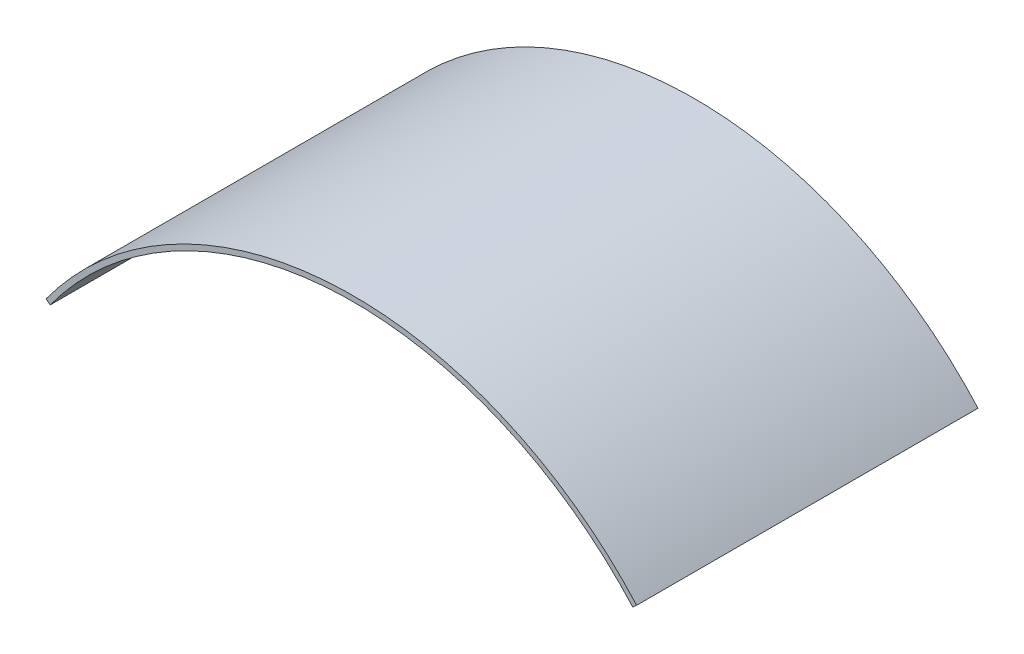
ISO-10303-21;
HEADER;
FILE_DESCRIPTION(('STEP AP214'),'2;1');
FILE_NAME('part.step','',(''),(''),'','','');
FILE_SCHEMA(('AUTOMOTIVE_DESIGN { 1 0 10303 214 1 1 1 1 }'));
ENDSEC;
DATA;
#1=APPLICATION_CONTEXT('core data for automotive mechanical design processes');
#2=APPLICATION_PROTOCOL_DEFINITION('international standard','automotive_design',2000,#1);
#3=PRODUCT_CONTEXT('',#1,'mechanical');
#4=PRODUCT('Part','Part','',(#3));
#5=PRODUCT_RELATED_PRODUCT_CATEGORY('part','',(#4));
#6=PRODUCT_DEFINITION_FORMATION('','',#4);
#7=PRODUCT_DEFINITION_CONTEXT('part definition',#1,'design');
#8=PRODUCT_DEFINITION('design','',#6,#7);
#9=PRODUCT_DEFINITION_SHAPE('','',#8);
#10=(LENGTH_UNIT() NAMED_UNIT(*) SI_UNIT(.MILLI.,.METRE.));
#11=(NAMED_UNIT(*) PLANE_ANGLE_UNIT() SI_UNIT($,.RADIAN.));
#12=(NAMED_UNIT(*) SI_UNIT($,.STERADIAN.) SOLID_ANGLE_UNIT());
#13=UNCERTAINTY_MEASURE_WITH_UNIT(LENGTH_MEASURE(1.E-05),#10,'distance_accuracy_value','');
#14=(GEOMETRIC_REPRESENTATION_CONTEXT(3) GLOBAL_UNCERTAINTY_ASSIGNED_CONTEXT((#13)) GLOBAL_UNIT_ASSIGNED_CONTEXT((#10,
#11,#12)) REPRESENTATION_CONTEXT('',''));
#15=CARTESIAN_POINT('',(0.,0.,0.));
#16=DIRECTION('',(0.,0.,1.));
#17=DIRECTION('',(1.,0.,0.));
#18=AXIS2_PLACEMENT_3D('',#15,#16,#17);
#19=CARTESIAN_POINT('',(102.23472331392,-74.4996951874995,113.5));
#20=DIRECTION('',(0.,0.,-1.));
#21=DIRECTION('',(-1.,0.,0.));
#22=AXIS2_PLACEMENT_3D('',#19,#20,#21);
#23=CYLINDRICAL_SURFACE('',#22,126.499577999707);
#24=CARTESIAN_POINT('',(102.23472331392,-74.4996951874995,0.));
#25=DIRECTION('',(0.,0.,1.));
#26=DIRECTION('',(-1.,0.,0.));
#27=AXIS2_PLACEMENT_3D('',#24,#25,#26);
#28=CIRCLE('',#27,126.499577999707);
#29=CARTESIAN_POINT('',(196.404368836428,9.96462329237191,0.));
#30=VERTEX_POINT('',#29);
#31=CARTESIAN_POINT('',(0.,0.,0.));
#32=VERTEX_POINT('',#31);
#33=EDGE_CURVE('E113',#30,#32,#28,.T.);
#34=ORIENTED_EDGE('',*,*,#33,.T.);
#35=DIRECTION('',(0.,0.,-1.));
#36=VECTOR('',#35,1.);
#37=CARTESIAN_POINT('',(0.,0.,113.5));
#38=LINE('',#37,#36);
#39=CARTESIAN_POINT('',(0.,0.,113.5));
#40=VERTEX_POINT('',#39);
#41=EDGE_CURVE('E11',#40,#32,#38,.T.);
#42=ORIENTED_EDGE('',*,*,#41,.F.);
#43=CARTESIAN_POINT('',(102.23472331392,-74.4996951874995,113.5));
#44=DIRECTION('',(0.,0.,1.));
#45=DIRECTION('',(-1.,0.,0.));
#46=AXIS2_PLACEMENT_3D('',#43,#44,#45);
#47=CIRCLE('',#46,126.499577999707);
#48=CARTESIAN_POINT('',(196.404368836428,9.96462329237191,113.5));
#49=VERTEX_POINT('',#48);
#50=EDGE_CURVE('E96',#49,#40,#47,.T.);
#51=ORIENTED_EDGE('',*,*,#50,.F.);
#52=DIRECTION('',(0.,0.,-1.));
#53=VECTOR('',#52,1.);
#54=CARTESIAN_POINT('',(196.404368836428,9.96462329237191,113.5));
#55=LINE('',#54,#53);
#56=EDGE_CURVE('E109',#49,#30,#55,.T.);
#57=ORIENTED_EDGE('',*,*,#56,.T.);
#58=EDGE_LOOP('',(#34,#42,#51,#57));
#59=FACE_BOUND('',#58,.T.);
#60=ADVANCED_FACE('F38',(#59),#23,.T.);
#61=CARTESIAN_POINT('',(0.,0.,113.5));
#62=DIRECTION('',(0.58893236140023,0.80818232701263,0.));
#63=DIRECTION('',(-0.80818232701263,0.58893236140023,0.));
#64=AXIS2_PLACEMENT_3D('',#61,#62,#63);
#65=PLANE('',#64);
#66=DIRECTION('',(0.80818232701263,-0.58893236140023,0.));
#67=VECTOR('',#66,1.);
#68=CARTESIAN_POINT('',(0.,0.,0.));
#69=LINE('',#68,#67);
#70=CARTESIAN_POINT('',(1.4143190722721,-1.0306316324504,0.));
#71=VERTEX_POINT('',#70);
#72=EDGE_CURVE('E100',#32,#71,#69,.T.);
#73=ORIENTED_EDGE('',*,*,#72,.T.);
#74=DIRECTION('',(0.,0.,-1.));
#75=VECTOR('',#74,1.);
#76=CARTESIAN_POINT('',(1.4143190722721,-1.0306316324504,113.5));
#77=LINE('',#76,#75);
#78=CARTESIAN_POINT('',(1.4143190722721,-1.0306316324504,113.5));
#79=VERTEX_POINT('',#78);
#80=EDGE_CURVE('E47',#79,#71,#77,.T.);
#81=ORIENTED_EDGE('',*,*,#80,.F.);
#82=DIRECTION('',(0.80818232701263,-0.58893236140023,0.));
#83=VECTOR('',#82,1.);
#84=CARTESIAN_POINT('',(0.,0.,113.5));
#85=LINE('',#84,#83);
#86=EDGE_CURVE('E91',#40,#79,#85,.T.);
#87=ORIENTED_EDGE('',*,*,#86,.F.);
#88=ORIENTED_EDGE('',*,*,#41,.T.);
#89=EDGE_LOOP('',(#73,#81,#87,#88));
#90=FACE_BOUND('',#89,.T.);
#91=ADVANCED_FACE('F99',(#90),#65,.F.);
#92=CARTESIAN_POINT('',(102.23472331392,-74.4996951874995,113.5));
#93=DIRECTION('',(0.,0.,-1.));
#94=DIRECTION('',(-1.,0.,0.));
#95=AXIS2_PLACEMENT_3D('',#92,#93,#94);
#96=CYLINDRICAL_SURFACE('',#95,124.749577999707);
#97=CARTESIAN_POINT('',(102.23472331392,-74.4996951874995,0.));
#98=DIRECTION('',(0.,0.,-1.));
#99=DIRECTION('',(-1.,0.,0.));
#100=AXIS2_PLACEMENT_3D('',#97,#98,#99);
#101=CIRCLE('',#100,124.749577999707);
#102=CARTESIAN_POINT('',(195.10162235877,8.79614068019977,0.));
#103=VERTEX_POINT('',#102);
#104=EDGE_CURVE('E78',#71,#103,#101,.T.);
#105=ORIENTED_EDGE('',*,*,#104,.T.);
#106=DIRECTION('',(0.,0.,-1.));
#107=VECTOR('',#106,1.);
#108=CARTESIAN_POINT('',(195.10162235877,8.79614068019977,113.5));
#109=LINE('',#108,#107);
#110=CARTESIAN_POINT('',(195.10162235877,8.79614068019977,113.5));
#111=VERTEX_POINT('',#110);
#112=EDGE_CURVE('E102',#111,#103,#109,.T.);
#113=ORIENTED_EDGE('',*,*,#112,.F.);
#114=CARTESIAN_POINT('',(102.23472331392,-74.4996951874995,113.5));
#115=DIRECTION('',(0.,0.,-1.));
#116=DIRECTION('',(-1.,0.,0.));
#117=AXIS2_PLACEMENT_3D('',#114,#115,#116);
#118=CIRCLE('',#117,124.749577999707);
#119=EDGE_CURVE('E94',#79,#111,#118,.T.);
#120=ORIENTED_EDGE('',*,*,#119,.F.);
#121=ORIENTED_EDGE('',*,*,#80,.T.);
#122=EDGE_LOOP('',(#105,#113,#120,#121));
#123=FACE_BOUND('',#122,.T.);
#124=ADVANCED_FACE('F103',(#123),#96,.F.);
#125=CARTESIAN_POINT('',(196.404368836428,9.96462329237191,113.5));
#126=DIRECTION('',(-0.667704349812663,0.744426558661933,0.));
#127=DIRECTION('',(-0.744426558661933,-0.667704349812663,0.));
#128=AXIS2_PLACEMENT_3D('',#125,#126,#127);
#129=PLANE('',#128);
#130=DIRECTION('',(0.744426558661933,0.667704349812663,0.));
#131=VECTOR('',#130,1.);
#132=CARTESIAN_POINT('',(196.404368836428,9.96462329237191,0.));
#133=LINE('',#132,#131);
#134=EDGE_CURVE('E84',#103,#30,#133,.T.);
#135=ORIENTED_EDGE('',*,*,#134,.T.);
#136=ORIENTED_EDGE('',*,*,#56,.F.);
#137=DIRECTION('',(0.744426558661933,0.667704349812663,0.));
#138=VECTOR('',#137,1.);
#139=CARTESIAN_POINT('',(196.404368836428,9.96462329237191,113.5));
#140=LINE('',#139,#138);
#141=EDGE_CURVE('E58',#111,#49,#140,.T.);
#142=ORIENTED_EDGE('',*,*,#141,.F.);
#143=ORIENTED_EDGE('',*,*,#112,.T.);
#144=EDGE_LOOP('',(#135,#136,#142,#143));
#145=FACE_BOUND('',#144,.T.);
#146=ADVANCED_FACE('F125',(#145),#129,.F.);
#147=CARTESIAN_POINT('',(102.23472331392,-74.4996951874995,113.5));
#148=DIRECTION('',(0.,0.,-1.));
#149=DIRECTION('',(-1.,0.,0.));
#150=AXIS2_PLACEMENT_3D('',#147,#148,#149);
#151=PLANE('',#150);
#152=ORIENTED_EDGE('',*,*,#50,.T.);
#153=ORIENTED_EDGE('',*,*,#86,.T.);
#154=ORIENTED_EDGE('',*,*,#119,.T.);
#155=ORIENTED_EDGE('',*,*,#141,.T.);
#156=EDGE_LOOP('',(#152,#153,#154,#155));
#157=FACE_BOUND('',#156,.T.);
#158=ADVANCED_FACE('F92',(#157),#151,.F.);
#159=CARTESIAN_POINT('',(102.23472331392,-74.4996951874995,0.));
#160=DIRECTION('',(0.,0.,-1.));
#161=DIRECTION('',(-1.,0.,0.));
#162=AXIS2_PLACEMENT_3D('',#159,#160,#161);
#163=PLANE('',#162);
#164=ORIENTED_EDGE('',*,*,#33,.F.);
#165=ORIENTED_EDGE('',*,*,#134,.F.);
#166=ORIENTED_EDGE('',*,*,#104,.F.);
#167=ORIENTED_EDGE('',*,*,#72,.F.);
#168=EDGE_LOOP('',(#164,#165,#166,#167));
#169=FACE_BOUND('',#168,.T.);
#170=ADVANCED_FACE('F128',(#169),#163,.T.);
#171=CLOSED_SHELL('',(#60,#91,#124,#146,#158,#170));
#172=MANIFOLD_SOLID_BREP('B2',#171);
#173=ADVANCED_BREP_SHAPE_REPRESENTATION('',(#18,#172),#14);
#174=SHAPE_DEFINITION_REPRESENTATION(#9,#173);
ENDSEC;
END-ISO-10303-21;
